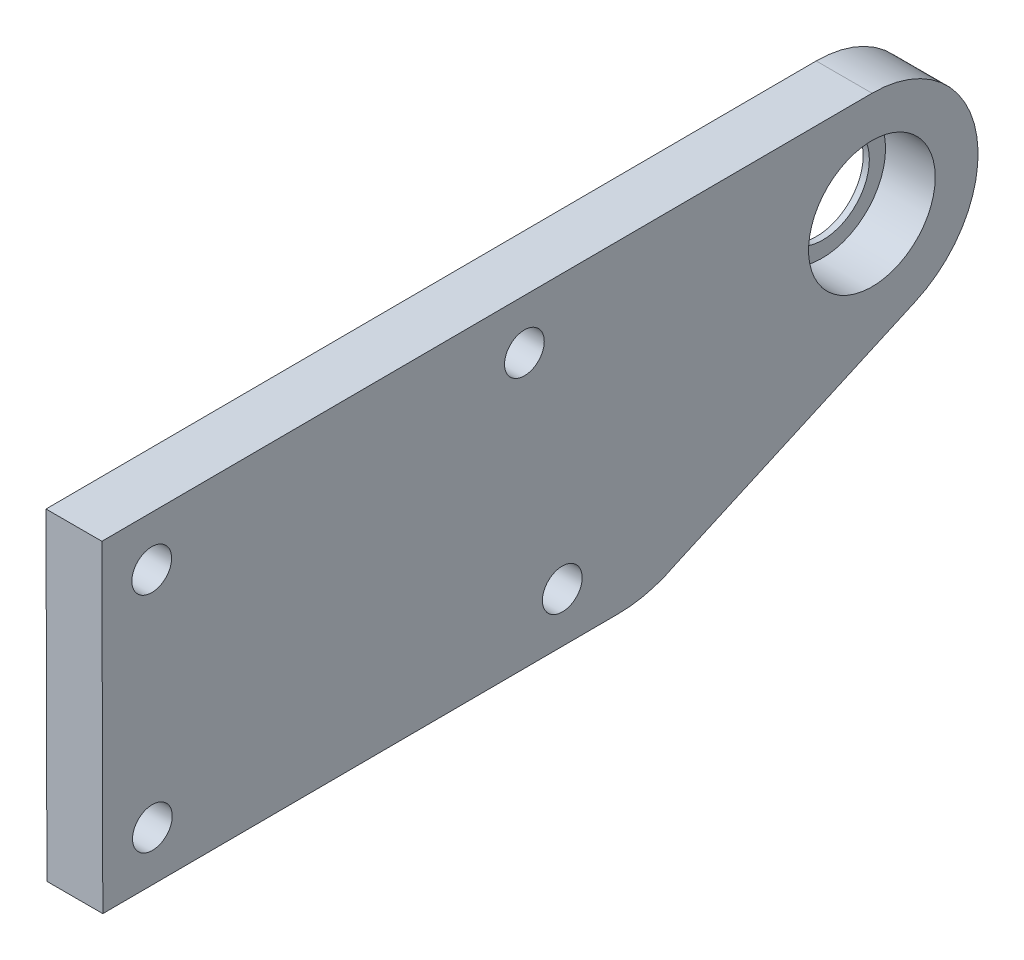
ISO-10303-21;
HEADER;
FILE_DESCRIPTION(('STEP AP214'),'2;1');
FILE_NAME('part.step','',(''),(''),'','','');
FILE_SCHEMA(('AUTOMOTIVE_DESIGN { 1 0 10303 214 1 1 1 1 }'));
ENDSEC;
DATA;
#1=APPLICATION_CONTEXT('core data for automotive mechanical design processes');
#2=APPLICATION_PROTOCOL_DEFINITION('international standard','automotive_design',2000,#1);
#3=PRODUCT_CONTEXT('',#1,'mechanical');
#4=PRODUCT('Part','Part','',(#3));
#5=PRODUCT_RELATED_PRODUCT_CATEGORY('part','',(#4));
#6=PRODUCT_DEFINITION_FORMATION('','',#4);
#7=PRODUCT_DEFINITION_CONTEXT('part definition',#1,'design');
#8=PRODUCT_DEFINITION('design','',#6,#7);
#9=PRODUCT_DEFINITION_SHAPE('','',#8);
#10=(LENGTH_UNIT() NAMED_UNIT(*) SI_UNIT(.MILLI.,.METRE.));
#11=(NAMED_UNIT(*) PLANE_ANGLE_UNIT() SI_UNIT($,.RADIAN.));
#12=(NAMED_UNIT(*) SI_UNIT($,.STERADIAN.) SOLID_ANGLE_UNIT());
#13=UNCERTAINTY_MEASURE_WITH_UNIT(LENGTH_MEASURE(1.E-05),#10,'distance_accuracy_value','');
#14=(GEOMETRIC_REPRESENTATION_CONTEXT(3) GLOBAL_UNCERTAINTY_ASSIGNED_CONTEXT((#13)) GLOBAL_UNIT_ASSIGNED_CONTEXT((#10,
#11,#12)) REPRESENTATION_CONTEXT('',''));
#15=CARTESIAN_POINT('',(0.,0.,0.));
#16=DIRECTION('',(0.,0.,1.));
#17=DIRECTION('',(1.,0.,0.));
#18=AXIS2_PLACEMENT_3D('',#15,#16,#17);
#19=CARTESIAN_POINT('',(4.5,-0.106733722255043,-0.0468506708539574));
#20=DIRECTION('',(-1.,0.,0.));
#21=DIRECTION('',(0.,0.,1.));
#22=AXIS2_PLACEMENT_3D('',#19,#20,#21);
#23=CYLINDRICAL_SURFACE('',#22,3.75);
#24=CARTESIAN_POINT('',(0.,-0.106733722255043,-0.0468506708539574));
#25=DIRECTION('',(1.,0.,0.));
#26=DIRECTION('',(0.,0.,-1.));
#27=AXIS2_PLACEMENT_3D('',#24,#25,#26);
#28=CIRCLE('',#27,3.75);
#29=CARTESIAN_POINT('',(0.,-0.106733722255043,-3.79685067085396));
#30=VERTEX_POINT('',#29);
#31=EDGE_CURVE('E126',#30,#30,#28,.T.);
#32=ORIENTED_EDGE('',*,*,#31,.F.);
#33=EDGE_LOOP('',(#32));
#34=FACE_BOUND('',#33,.T.);
#35=CARTESIAN_POINT('',(0.5,-0.106733722255043,-0.0468506708539574));
#36=DIRECTION('',(1.,0.,0.));
#37=DIRECTION('',(0.,0.,-1.));
#38=AXIS2_PLACEMENT_3D('',#35,#36,#37);
#39=CIRCLE('',#38,3.75);
#40=CARTESIAN_POINT('',(0.5,-0.106733722255043,-3.79685067085396));
#41=VERTEX_POINT('',#40);
#42=EDGE_CURVE('E39',#41,#41,#39,.T.);
#43=ORIENTED_EDGE('',*,*,#42,.T.);
#44=EDGE_LOOP('',(#43));
#45=FACE_BOUND('',#44,.T.);
#46=ADVANCED_FACE('F35',(#34,#45),#23,.F.);
#47=CARTESIAN_POINT('',(4.5,-0.106733722255043,-0.0468506708539574));
#48=DIRECTION('',(1.,0.,0.));
#49=DIRECTION('',(0.,0.,-1.));
#50=AXIS2_PLACEMENT_3D('',#47,#48,#49);
#51=PLANE('',#50);
#52=CARTESIAN_POINT('',(4.5,0.,0.));
#53=DIRECTION('',(1.,0.,0.));
#54=DIRECTION('',(0.,0.,-1.));
#55=AXIS2_PLACEMENT_3D('',#52,#53,#54);
#56=CIRCLE('',#55,5.1);
#57=CARTESIAN_POINT('',(4.5,0.,-5.1));
#58=VERTEX_POINT('',#57);
#59=EDGE_CURVE('E273',#58,#58,#56,.T.);
#60=ORIENTED_EDGE('',*,*,#59,.F.);
#61=EDGE_LOOP('',(#60));
#62=FACE_BOUND('',#61,.T.);
#63=CARTESIAN_POINT('',(4.5,-13.8283949829715,57.9219923127837));
#64=DIRECTION('',(1.,0.,0.));
#65=DIRECTION('',(0.,0.,-1.));
#66=AXIS2_PLACEMENT_3D('',#63,#64,#65);
#67=CIRCLE('',#66,1.59999999999998);
#68=CARTESIAN_POINT('',(4.5,-13.8283949829715,56.3219923127837));
#69=VERTEX_POINT('',#68);
#70=EDGE_CURVE('E285',#69,#69,#67,.T.);
#71=ORIENTED_EDGE('',*,*,#70,.F.);
#72=EDGE_LOOP('',(#71));
#73=FACE_BOUND('',#72,.T.);
#74=CARTESIAN_POINT('',(4.5,4.17153069602394,57.9737180379248));
#75=DIRECTION('',(1.,0.,0.));
#76=DIRECTION('',(0.,0.,-1.));
#77=AXIS2_PLACEMENT_3D('',#74,#75,#76);
#78=CIRCLE('',#77,1.60000000000002);
#79=CARTESIAN_POINT('',(4.5,4.17153069602394,56.3737180379248));
#80=VERTEX_POINT('',#79);
#81=EDGE_CURVE('E297',#80,#80,#78,.T.);
#82=ORIENTED_EDGE('',*,*,#81,.F.);
#83=EDGE_LOOP('',(#82));
#84=FACE_BOUND('',#83,.T.);
#85=CARTESIAN_POINT('',(4.5,-0.106733722255043,-0.0468506708539574));
#86=DIRECTION('',(1.,0.,0.));
#87=DIRECTION('',(0.,0.,-1.));
#88=AXIS2_PLACEMENT_3D('',#85,#86,#87);
#89=CIRCLE('',#88,8.5);
#90=CARTESIAN_POINT('',(4.5,-7.87874411310509,-3.4886313850365));
#91=VERTEX_POINT('',#90);
#92=CARTESIAN_POINT('',(4.5,8.39320418801906,-0.0143618807086007));
#93=VERTEX_POINT('',#92);
#94=EDGE_CURVE('E133',#91,#93,#89,.T.);
#95=ORIENTED_EDGE('',*,*,#94,.T.);
#96=DIRECTION('',(0.,-0.00382221060533605,0.999992695326365));
#97=VECTOR('',#96,1.);
#98=CARTESIAN_POINT('',(4.5,8.15622713048823,61.985185229526));
#99=LINE('',#98,#97);
#100=CARTESIAN_POINT('',(4.5,8.15622713048823,61.985185229526));
#101=VERTEX_POINT('',#100);
#102=EDGE_CURVE('E90',#93,#101,#99,.T.);
#103=ORIENTED_EDGE('',*,*,#102,.T.);
#104=DIRECTION('',(0.,-0.999995871055301,-0.00287365139676017));
#105=VECTOR('',#104,1.);
#106=CARTESIAN_POINT('',(4.5,8.15622713048823,61.985185229526));
#107=LINE('',#106,#105);
#108=CARTESIAN_POINT('',(4.5,-17.8436655169496,61.9104702932103));
#109=VERTEX_POINT('',#108);
#110=EDGE_CURVE('E104',#101,#109,#107,.T.);
#111=ORIENTED_EDGE('',*,*,#110,.T.);
#112=DIRECTION('',(0.,0.00382221060533609,-0.999992695326365));
#113=VECTOR('',#112,1.);
#114=CARTESIAN_POINT('',(4.5,-17.8436655169496,61.9104702932103));
#115=LINE('',#114,#113);
#116=CARTESIAN_POINT('',(4.5,-17.6850437768281,20.4107734371661));
#117=VERTEX_POINT('',#116);
#118=EDGE_CURVE('E97',#109,#117,#115,.T.);
#119=ORIENTED_EDGE('',*,*,#118,.T.);
#120=CARTESIAN_POINT('',(4.5,-7.68511682356459,20.4489955432195));
#121=DIRECTION('',(1.,0.,0.));
#122=DIRECTION('',(0.,0.,-1.));
#123=AXIS2_PLACEMENT_3D('',#120,#121,#122);
#124=CIRCLE('',#123,9.99999999999991);
#125=CARTESIAN_POINT('',(4.5,-16.5375339574447,15.7976827298533));
#126=VERTEX_POINT('',#125);
#127=EDGE_CURVE('E102',#117,#126,#124,.T.);
#128=ORIENTED_EDGE('',*,*,#127,.T.);
#129=DIRECTION('',(0.,0.409575774501175,-0.912276101266367));
#130=VECTOR('',#129,1.);
#131=CARTESIAN_POINT('',(4.5,-16.5375339574447,15.7976827298533));
#132=LINE('',#131,#130);
#133=EDGE_CURVE('E53',#126,#91,#132,.T.);
#134=ORIENTED_EDGE('',*,*,#133,.T.);
#135=EDGE_LOOP('',(#95,#103,#111,#119,#128,#134));
#136=FACE_BOUND('',#135,.T.);
#137=CARTESIAN_POINT('',(4.5,4.28619701418347,27.9739371781339));
#138=DIRECTION('',(1.,0.,0.));
#139=DIRECTION('',(0.,0.,-1.));
#140=AXIS2_PLACEMENT_3D('',#137,#138,#139);
#141=CIRCLE('',#140,1.60000000000002);
#142=CARTESIAN_POINT('',(4.5,4.28619701418347,26.3739371781338));
#143=VERTEX_POINT('',#142);
#144=EDGE_CURVE('E291',#143,#143,#141,.T.);
#145=ORIENTED_EDGE('',*,*,#144,.F.);
#146=EDGE_LOOP('',(#145));
#147=FACE_BOUND('',#146,.T.);
#148=CARTESIAN_POINT('',(4.5,-13.7022701309082,24.9222333360625));
#149=DIRECTION('',(1.,0.,0.));
#150=DIRECTION('',(0.,0.,-1.));
#151=AXIS2_PLACEMENT_3D('',#148,#149,#150);
#152=CIRCLE('',#151,1.59999999999999);
#153=CARTESIAN_POINT('',(4.5,-13.7022701309082,23.3222333360625));
#154=VERTEX_POINT('',#153);
#155=EDGE_CURVE('E279',#154,#154,#152,.T.);
#156=ORIENTED_EDGE('',*,*,#155,.F.);
#157=EDGE_LOOP('',(#156));
#158=FACE_BOUND('',#157,.T.);
#159=ADVANCED_FACE('F99',(#62,#73,#84,#136,#147,#158),#51,.T.);
#160=CARTESIAN_POINT('',(0.,-0.106733722255043,-0.0468506708539574));
#161=DIRECTION('',(1.,0.,0.));
#162=DIRECTION('',(0.,0.,-1.));
#163=AXIS2_PLACEMENT_3D('',#160,#161,#162);
#164=PLANE('',#163);
#165=CARTESIAN_POINT('',(0.,-0.106733722255043,-0.0468506708539574));
#166=DIRECTION('',(1.,0.,0.));
#167=DIRECTION('',(0.,0.,-1.));
#168=AXIS2_PLACEMENT_3D('',#165,#166,#167);
#169=CIRCLE('',#168,8.5);
#170=CARTESIAN_POINT('',(0.,-7.87874411310509,-3.4886313850365));
#171=VERTEX_POINT('',#170);
#172=CARTESIAN_POINT('',(0.,8.39320418801906,-0.0143618807086007));
#173=VERTEX_POINT('',#172);
#174=EDGE_CURVE('E122',#171,#173,#169,.T.);
#175=ORIENTED_EDGE('',*,*,#174,.F.);
#176=DIRECTION('',(0.,0.409575774501175,-0.912276101266367));
#177=VECTOR('',#176,1.);
#178=CARTESIAN_POINT('',(0.,-16.5375339574447,15.7976827298533));
#179=LINE('',#178,#177);
#180=CARTESIAN_POINT('',(0.,-16.5375339574447,15.7976827298533));
#181=VERTEX_POINT('',#180);
#182=EDGE_CURVE('E82',#181,#171,#179,.T.);
#183=ORIENTED_EDGE('',*,*,#182,.F.);
#184=CARTESIAN_POINT('',(0.,-7.68511682356459,20.4489955432195));
#185=DIRECTION('',(1.,0.,0.));
#186=DIRECTION('',(0.,0.,-1.));
#187=AXIS2_PLACEMENT_3D('',#184,#185,#186);
#188=CIRCLE('',#187,9.99999999999991);
#189=CARTESIAN_POINT('',(0.,-17.6850437768281,20.4107734371661));
#190=VERTEX_POINT('',#189);
#191=EDGE_CURVE('E76',#190,#181,#188,.T.);
#192=ORIENTED_EDGE('',*,*,#191,.F.);
#193=DIRECTION('',(0.,0.00382221060533609,-0.999992695326365));
#194=VECTOR('',#193,1.);
#195=CARTESIAN_POINT('',(0.,-17.8436655169496,61.9104702932103));
#196=LINE('',#195,#194);
#197=CARTESIAN_POINT('',(0.,-17.8436655169496,61.9104702932103));
#198=VERTEX_POINT('',#197);
#199=EDGE_CURVE('E112',#198,#190,#196,.T.);
#200=ORIENTED_EDGE('',*,*,#199,.F.);
#201=DIRECTION('',(0.,-0.999995871055301,-0.00287365139676017));
#202=VECTOR('',#201,1.);
#203=CARTESIAN_POINT('',(0.,8.15622713048823,61.985185229526));
#204=LINE('',#203,#202);
#205=CARTESIAN_POINT('',(0.,8.15622713048823,61.985185229526));
#206=VERTEX_POINT('',#205);
#207=EDGE_CURVE('E128',#206,#198,#204,.T.);
#208=ORIENTED_EDGE('',*,*,#207,.F.);
#209=DIRECTION('',(0.,-0.00382221060533605,0.999992695326365));
#210=VECTOR('',#209,1.);
#211=CARTESIAN_POINT('',(0.,8.15622713048823,61.985185229526));
#212=LINE('',#211,#210);
#213=EDGE_CURVE('E125',#173,#206,#212,.T.);
#214=ORIENTED_EDGE('',*,*,#213,.F.);
#215=EDGE_LOOP('',(#175,#183,#192,#200,#208,#214));
#216=FACE_BOUND('',#215,.T.);
#217=ORIENTED_EDGE('',*,*,#31,.T.);
#218=EDGE_LOOP('',(#217));
#219=FACE_BOUND('',#218,.T.);
#220=CARTESIAN_POINT('',(0.,4.17153069602394,57.9737180379248));
#221=DIRECTION('',(1.,0.,0.));
#222=DIRECTION('',(0.,0.,-1.));
#223=AXIS2_PLACEMENT_3D('',#220,#221,#222);
#224=CIRCLE('',#223,1.60000000000002);
#225=CARTESIAN_POINT('',(0.,4.17153069602394,56.3737180379248));
#226=VERTEX_POINT('',#225);
#227=EDGE_CURVE('E294',#226,#226,#224,.T.);
#228=ORIENTED_EDGE('',*,*,#227,.T.);
#229=EDGE_LOOP('',(#228));
#230=FACE_BOUND('',#229,.T.);
#231=CARTESIAN_POINT('',(0.,4.28619701418347,27.9739371781339));
#232=DIRECTION('',(1.,0.,0.));
#233=DIRECTION('',(0.,0.,-1.));
#234=AXIS2_PLACEMENT_3D('',#231,#232,#233);
#235=CIRCLE('',#234,1.60000000000002);
#236=CARTESIAN_POINT('',(0.,4.28619701418347,26.3739371781338));
#237=VERTEX_POINT('',#236);
#238=EDGE_CURVE('E288',#237,#237,#235,.T.);
#239=ORIENTED_EDGE('',*,*,#238,.T.);
#240=EDGE_LOOP('',(#239));
#241=FACE_BOUND('',#240,.T.);
#242=CARTESIAN_POINT('',(0.,-13.8283949829715,57.9219923127837));
#243=DIRECTION('',(1.,0.,0.));
#244=DIRECTION('',(0.,0.,-1.));
#245=AXIS2_PLACEMENT_3D('',#242,#243,#244);
#246=CIRCLE('',#245,1.59999999999998);
#247=CARTESIAN_POINT('',(0.,-13.8283949829715,56.3219923127837));
#248=VERTEX_POINT('',#247);
#249=EDGE_CURVE('E282',#248,#248,#246,.T.);
#250=ORIENTED_EDGE('',*,*,#249,.T.);
#251=EDGE_LOOP('',(#250));
#252=FACE_BOUND('',#251,.T.);
#253=CARTESIAN_POINT('',(0.,-13.7022701309082,24.9222333360625));
#254=DIRECTION('',(1.,0.,0.));
#255=DIRECTION('',(0.,0.,-1.));
#256=AXIS2_PLACEMENT_3D('',#253,#254,#255);
#257=CIRCLE('',#256,1.59999999999999);
#258=CARTESIAN_POINT('',(0.,-13.7022701309082,23.3222333360625));
#259=VERTEX_POINT('',#258);
#260=EDGE_CURVE('E275',#259,#259,#257,.T.);
#261=ORIENTED_EDGE('',*,*,#260,.T.);
#262=EDGE_LOOP('',(#261));
#263=FACE_BOUND('',#262,.T.);
#264=ADVANCED_FACE('F143',(#216,#219,#230,#241,#252,#263),#164,.F.);
#265=CARTESIAN_POINT('',(4.5,-0.106733722255043,-0.0468506708539574));
#266=DIRECTION('',(-1.,0.,0.));
#267=DIRECTION('',(0.,0.,1.));
#268=AXIS2_PLACEMENT_3D('',#265,#266,#267);
#269=CYLINDRICAL_SURFACE('',#268,8.5);
#270=ORIENTED_EDGE('',*,*,#174,.T.);
#271=DIRECTION('',(-1.,0.,0.));
#272=VECTOR('',#271,1.);
#273=CARTESIAN_POINT('',(4.5,8.39320418801906,-0.0143618807086007));
#274=LINE('',#273,#272);
#275=EDGE_CURVE('E11',#93,#173,#274,.T.);
#276=ORIENTED_EDGE('',*,*,#275,.F.);
#277=ORIENTED_EDGE('',*,*,#94,.F.);
#278=DIRECTION('',(-1.,0.,0.));
#279=VECTOR('',#278,1.);
#280=CARTESIAN_POINT('',(4.5,-7.87874411310509,-3.4886313850365));
#281=LINE('',#280,#279);
#282=EDGE_CURVE('E118',#91,#171,#281,.T.);
#283=ORIENTED_EDGE('',*,*,#282,.T.);
#284=EDGE_LOOP('',(#270,#276,#277,#283));
#285=FACE_BOUND('',#284,.T.);
#286=ADVANCED_FACE('F37',(#285),#269,.T.);
#287=CARTESIAN_POINT('',(4.5,8.15622713048823,61.985185229526));
#288=DIRECTION('',(0.,-0.999992695326365,-0.00382221060533605));
#289=DIRECTION('',(0.,0.00382221060533605,-0.999992695326365));
#290=AXIS2_PLACEMENT_3D('',#287,#288,#289);
#291=PLANE('',#290);
#292=ORIENTED_EDGE('',*,*,#213,.T.);
#293=DIRECTION('',(-1.,0.,0.));
#294=VECTOR('',#293,1.);
#295=CARTESIAN_POINT('',(4.5,8.15622713048823,61.985185229526));
#296=LINE('',#295,#294);
#297=EDGE_CURVE('E45',#101,#206,#296,.T.);
#298=ORIENTED_EDGE('',*,*,#297,.F.);
#299=ORIENTED_EDGE('',*,*,#102,.F.);
#300=ORIENTED_EDGE('',*,*,#275,.T.);
#301=EDGE_LOOP('',(#292,#298,#299,#300));
#302=FACE_BOUND('',#301,.T.);
#303=ADVANCED_FACE('F176',(#302),#291,.F.);
#304=CARTESIAN_POINT('',(4.5,8.15622713048823,61.985185229526));
#305=DIRECTION('',(0.,0.00287365139676017,-0.999995871055301));
#306=DIRECTION('',(0.,0.999995871055301,0.00287365139676017));
#307=AXIS2_PLACEMENT_3D('',#304,#305,#306);
#308=PLANE('',#307);
#309=ORIENTED_EDGE('',*,*,#207,.T.);
#310=DIRECTION('',(-1.,0.,0.));
#311=VECTOR('',#310,1.);
#312=CARTESIAN_POINT('',(4.5,-17.8436655169496,61.9104702932103));
#313=LINE('',#312,#311);
#314=EDGE_CURVE('E113',#109,#198,#313,.T.);
#315=ORIENTED_EDGE('',*,*,#314,.F.);
#316=ORIENTED_EDGE('',*,*,#110,.F.);
#317=ORIENTED_EDGE('',*,*,#297,.T.);
#318=EDGE_LOOP('',(#309,#315,#316,#317));
#319=FACE_BOUND('',#318,.T.);
#320=ADVANCED_FACE('F140',(#319),#308,.F.);
#321=CARTESIAN_POINT('',(4.5,-17.8436655169496,61.9104702932103));
#322=DIRECTION('',(0.,0.999992695326365,0.00382221060533609));
#323=DIRECTION('',(0.,-0.00382221060533609,0.999992695326365));
#324=AXIS2_PLACEMENT_3D('',#321,#322,#323);
#325=PLANE('',#324);
#326=ORIENTED_EDGE('',*,*,#199,.T.);
#327=DIRECTION('',(-1.,0.,0.));
#328=VECTOR('',#327,1.);
#329=CARTESIAN_POINT('',(4.5,-17.6850437768281,20.4107734371661));
#330=LINE('',#329,#328);
#331=EDGE_CURVE('E109',#117,#190,#330,.T.);
#332=ORIENTED_EDGE('',*,*,#331,.F.);
#333=ORIENTED_EDGE('',*,*,#118,.F.);
#334=ORIENTED_EDGE('',*,*,#314,.T.);
#335=EDGE_LOOP('',(#326,#332,#333,#334));
#336=FACE_BOUND('',#335,.T.);
#337=ADVANCED_FACE('F110',(#336),#325,.F.);
#338=CARTESIAN_POINT('',(4.5,-7.68511682356459,20.4489955432195));
#339=DIRECTION('',(-1.,0.,0.));
#340=DIRECTION('',(0.,0.,1.));
#341=AXIS2_PLACEMENT_3D('',#338,#339,#340);
#342=CYLINDRICAL_SURFACE('',#341,9.99999999999991);
#343=ORIENTED_EDGE('',*,*,#191,.T.);
#344=DIRECTION('',(-1.,0.,0.));
#345=VECTOR('',#344,1.);
#346=CARTESIAN_POINT('',(4.5,-16.5375339574447,15.7976827298533));
#347=LINE('',#346,#345);
#348=EDGE_CURVE('E114',#126,#181,#347,.T.);
#349=ORIENTED_EDGE('',*,*,#348,.F.);
#350=ORIENTED_EDGE('',*,*,#127,.F.);
#351=ORIENTED_EDGE('',*,*,#331,.T.);
#352=EDGE_LOOP('',(#343,#349,#350,#351));
#353=FACE_BOUND('',#352,.T.);
#354=ADVANCED_FACE('F116',(#353),#342,.T.);
#355=CARTESIAN_POINT('',(4.5,-16.5375339574447,15.7976827298533));
#356=DIRECTION('',(0.,0.912276101266367,0.409575774501175));
#357=DIRECTION('',(0.,-0.409575774501175,0.912276101266367));
#358=AXIS2_PLACEMENT_3D('',#355,#356,#357);
#359=PLANE('',#358);
#360=ORIENTED_EDGE('',*,*,#182,.T.);
#361=ORIENTED_EDGE('',*,*,#282,.F.);
#362=ORIENTED_EDGE('',*,*,#133,.F.);
#363=ORIENTED_EDGE('',*,*,#348,.T.);
#364=EDGE_LOOP('',(#360,#361,#362,#363));
#365=FACE_BOUND('',#364,.T.);
#366=ADVANCED_FACE('F148',(#365),#359,.F.);
#367=CARTESIAN_POINT('',(4.5,4.17153069602394,57.9737180379248));
#368=DIRECTION('',(-1.,0.,0.));
#369=DIRECTION('',(0.,0.,1.));
#370=AXIS2_PLACEMENT_3D('',#367,#368,#369);
#371=CYLINDRICAL_SURFACE('',#370,1.60000000000002);
#372=ORIENTED_EDGE('',*,*,#81,.T.);
#373=EDGE_LOOP('',(#372));
#374=FACE_BOUND('',#373,.T.);
#375=ORIENTED_EDGE('',*,*,#227,.F.);
#376=EDGE_LOOP('',(#375));
#377=FACE_BOUND('',#376,.T.);
#378=ADVANCED_FACE('F150',(#374,#377),#371,.F.);
#379=CARTESIAN_POINT('',(4.5,4.28619701418347,27.9739371781339));
#380=DIRECTION('',(-1.,0.,0.));
#381=DIRECTION('',(0.,0.,1.));
#382=AXIS2_PLACEMENT_3D('',#379,#380,#381);
#383=CYLINDRICAL_SURFACE('',#382,1.60000000000002);
#384=ORIENTED_EDGE('',*,*,#144,.T.);
#385=EDGE_LOOP('',(#384));
#386=FACE_BOUND('',#385,.T.);
#387=ORIENTED_EDGE('',*,*,#238,.F.);
#388=EDGE_LOOP('',(#387));
#389=FACE_BOUND('',#388,.T.);
#390=ADVANCED_FACE('F156',(#386,#389),#383,.F.);
#391=CARTESIAN_POINT('',(4.5,-13.8283949829715,57.9219923127837));
#392=DIRECTION('',(-1.,0.,0.));
#393=DIRECTION('',(0.,0.,1.));
#394=AXIS2_PLACEMENT_3D('',#391,#392,#393);
#395=CYLINDRICAL_SURFACE('',#394,1.59999999999998);
#396=ORIENTED_EDGE('',*,*,#70,.T.);
#397=EDGE_LOOP('',(#396));
#398=FACE_BOUND('',#397,.T.);
#399=ORIENTED_EDGE('',*,*,#249,.F.);
#400=EDGE_LOOP('',(#399));
#401=FACE_BOUND('',#400,.T.);
#402=ADVANCED_FACE('F213',(#398,#401),#395,.F.);
#403=CARTESIAN_POINT('',(4.5,-13.7022701309082,24.9222333360625));
#404=DIRECTION('',(-1.,0.,0.));
#405=DIRECTION('',(0.,0.,1.));
#406=AXIS2_PLACEMENT_3D('',#403,#404,#405);
#407=CYLINDRICAL_SURFACE('',#406,1.59999999999999);
#408=ORIENTED_EDGE('',*,*,#155,.T.);
#409=EDGE_LOOP('',(#408));
#410=FACE_BOUND('',#409,.T.);
#411=ORIENTED_EDGE('',*,*,#260,.F.);
#412=EDGE_LOOP('',(#411));
#413=FACE_BOUND('',#412,.T.);
#414=ADVANCED_FACE('F222',(#410,#413),#407,.F.);
#415=CARTESIAN_POINT('',(0.5,0.,0.));
#416=DIRECTION('',(1.,0.,0.));
#417=DIRECTION('',(0.,0.,-1.));
#418=AXIS2_PLACEMENT_3D('',#415,#416,#417);
#419=CYLINDRICAL_SURFACE('',#418,5.1);
#420=CARTESIAN_POINT('',(0.5,0.,0.));
#421=DIRECTION('',(1.,0.,0.));
#422=DIRECTION('',(0.,0.,-1.));
#423=AXIS2_PLACEMENT_3D('',#420,#421,#422);
#424=CIRCLE('',#423,5.1);
#425=CARTESIAN_POINT('',(0.5,0.,-5.1));
#426=VERTEX_POINT('',#425);
#427=EDGE_CURVE('E272',#426,#426,#424,.T.);
#428=ORIENTED_EDGE('',*,*,#427,.F.);
#429=EDGE_LOOP('',(#428));
#430=FACE_BOUND('',#429,.T.);
#431=ORIENTED_EDGE('',*,*,#59,.T.);
#432=EDGE_LOOP('',(#431));
#433=FACE_BOUND('',#432,.T.);
#434=ADVANCED_FACE('F231',(#430,#433),#419,.F.);
#435=CARTESIAN_POINT('',(0.5,0.,0.));
#436=DIRECTION('',(1.,0.,0.));
#437=DIRECTION('',(0.,0.,-1.));
#438=AXIS2_PLACEMENT_3D('',#435,#436,#437);
#439=PLANE('',#438);
#440=ORIENTED_EDGE('',*,*,#42,.F.);
#441=EDGE_LOOP('',(#440));
#442=FACE_BOUND('',#441,.T.);
#443=ORIENTED_EDGE('',*,*,#427,.T.);
#444=EDGE_LOOP('',(#443));
#445=FACE_BOUND('',#444,.T.);
#446=ADVANCED_FACE('F253',(#442,#445),#439,.T.);
#447=CLOSED_SHELL('',(#46,#159,#264,#286,#303,#320,#337,#354,#366,#378,#390,#402,#414,#434,#446));
#448=MANIFOLD_SOLID_BREP('B2',#447);
#449=ADVANCED_BREP_SHAPE_REPRESENTATION('',(#18,#448),#14);
#450=SHAPE_DEFINITION_REPRESENTATION(#9,#449);
ENDSEC;
END-ISO-10303-21;
